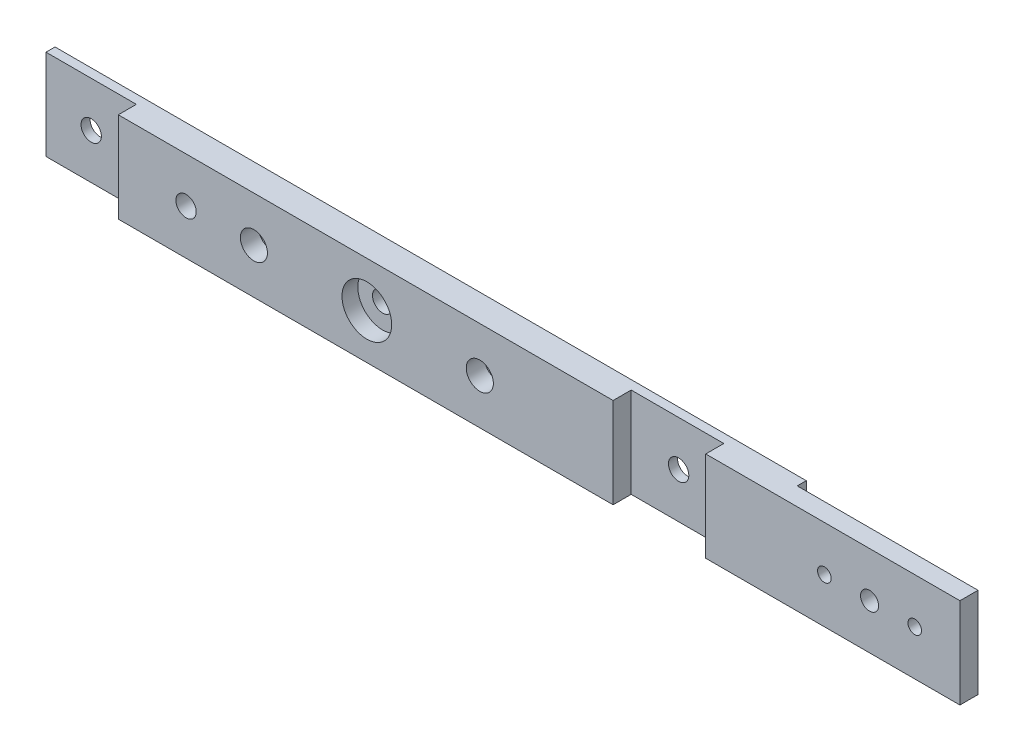
ISO-10303-21;
HEADER;
FILE_DESCRIPTION(('STEP AP214'),'2;1');
FILE_NAME('part.step','',(''),(''),'','','');
FILE_SCHEMA(('AUTOMOTIVE_DESIGN { 1 0 10303 214 1 1 1 1 }'));
ENDSEC;
DATA;
#1=APPLICATION_CONTEXT('core data for automotive mechanical design processes');
#2=APPLICATION_PROTOCOL_DEFINITION('international standard','automotive_design',2000,#1);
#3=PRODUCT_CONTEXT('',#1,'mechanical');
#4=PRODUCT('Part','Part','',(#3));
#5=PRODUCT_RELATED_PRODUCT_CATEGORY('part','',(#4));
#6=PRODUCT_DEFINITION_FORMATION('','',#4);
#7=PRODUCT_DEFINITION_CONTEXT('part definition',#1,'design');
#8=PRODUCT_DEFINITION('design','',#6,#7);
#9=PRODUCT_DEFINITION_SHAPE('','',#8);
#10=(LENGTH_UNIT() NAMED_UNIT(*) SI_UNIT(.MILLI.,.METRE.));
#11=(NAMED_UNIT(*) PLANE_ANGLE_UNIT() SI_UNIT($,.RADIAN.));
#12=(NAMED_UNIT(*) SI_UNIT($,.STERADIAN.) SOLID_ANGLE_UNIT());
#13=UNCERTAINTY_MEASURE_WITH_UNIT(LENGTH_MEASURE(1.E-05),#10,'distance_accuracy_value','');
#14=(GEOMETRIC_REPRESENTATION_CONTEXT(3) GLOBAL_UNCERTAINTY_ASSIGNED_CONTEXT((#13)) GLOBAL_UNIT_ASSIGNED_CONTEXT((#10,
#11,#12)) REPRESENTATION_CONTEXT('',''));
#15=CARTESIAN_POINT('',(0.,0.,0.));
#16=DIRECTION('',(0.,0.,1.));
#17=DIRECTION('',(1.,0.,0.));
#18=AXIS2_PLACEMENT_3D('',#15,#16,#17);
#19=CARTESIAN_POINT('',(185.410070824637,56.9647937411095,12.));
#20=DIRECTION('',(-1.,0.,0.));
#21=DIRECTION('',(0.,-1.,0.));
#22=AXIS2_PLACEMENT_3D('',#19,#20,#21);
#23=PLANE('',#22);
#24=DIRECTION('',(0.,-1.,0.));
#25=VECTOR('',#24,1.);
#26=CARTESIAN_POINT('',(185.410070824637,56.9647937411095,4.));
#27=LINE('',#26,#25);
#28=CARTESIAN_POINT('',(185.410070824637,56.9647937411095,4.));
#29=VERTEX_POINT('',#28);
#30=CARTESIAN_POINT('',(185.410070824637,16.9647937411095,4.));
#31=VERTEX_POINT('',#30);
#32=EDGE_CURVE('E124',#29,#31,#27,.T.);
#33=ORIENTED_EDGE('',*,*,#32,.F.);
#34=DIRECTION('',(0.,0.,-1.));
#35=VECTOR('',#34,1.);
#36=CARTESIAN_POINT('',(185.410070824637,56.9647937411095,12.));
#37=LINE('',#36,#35);
#38=CARTESIAN_POINT('',(185.410070824637,56.9647937411095,12.));
#39=VERTEX_POINT('',#38);
#40=EDGE_CURVE('E146',#39,#29,#37,.T.);
#41=ORIENTED_EDGE('',*,*,#40,.F.);
#42=DIRECTION('',(0.,1.,0.));
#43=VECTOR('',#42,1.);
#44=CARTESIAN_POINT('',(185.410070824637,56.9647937411095,12.));
#45=LINE('',#44,#43);
#46=CARTESIAN_POINT('',(185.410070824637,16.9647937411095,12.));
#47=VERTEX_POINT('',#46);
#48=EDGE_CURVE('E145',#47,#39,#45,.T.);
#49=ORIENTED_EDGE('',*,*,#48,.F.);
#50=DIRECTION('',(0.,0.,-1.));
#51=VECTOR('',#50,1.);
#52=CARTESIAN_POINT('',(185.410070824637,16.9647937411095,12.));
#53=LINE('',#52,#51);
#54=EDGE_CURVE('E43',#47,#31,#53,.T.);
#55=ORIENTED_EDGE('',*,*,#54,.T.);
#56=EDGE_LOOP('',(#33,#41,#49,#55));
#57=FACE_BOUND('',#56,.T.);
#58=ADVANCED_FACE('F34',(#57),#23,.F.);
#59=CARTESIAN_POINT('',(0.,0.,12.));
#60=DIRECTION('',(0.,0.,1.));
#61=DIRECTION('',(1.,0.,0.));
#62=AXIS2_PLACEMENT_3D('',#59,#60,#61);
#63=PLANE('',#62);
#64=CARTESIAN_POINT('',(-27.0899291753633,36.9647937411095,12.));
#65=DIRECTION('',(0.,0.,1.));
#66=DIRECTION('',(1.,0.,0.));
#67=AXIS2_PLACEMENT_3D('',#64,#65,#66);
#68=CIRCLE('',#67,6.);
#69=CARTESIAN_POINT('',(-21.0899291753633,36.9647937411095,12.));
#70=VERTEX_POINT('',#69);
#71=EDGE_CURVE('E454',#70,#70,#68,.T.);
#72=ORIENTED_EDGE('',*,*,#71,.F.);
#73=EDGE_LOOP('',(#72));
#74=FACE_BOUND('',#73,.T.);
#75=CARTESIAN_POINT('',(-127.089929175363,36.9647937411095,12.));
#76=DIRECTION('',(0.,0.,1.));
#77=DIRECTION('',(1.,0.,0.));
#78=AXIS2_PLACEMENT_3D('',#75,#76,#77);
#79=CIRCLE('',#78,6.00000000000002);
#80=CARTESIAN_POINT('',(-121.089929175363,36.9647937411095,12.));
#81=VERTEX_POINT('',#80);
#82=EDGE_CURVE('E447',#81,#81,#79,.T.);
#83=ORIENTED_EDGE('',*,*,#82,.F.);
#84=EDGE_LOOP('',(#83));
#85=FACE_BOUND('',#84,.T.);
#86=DIRECTION('',(0.,-1.,0.));
#87=VECTOR('',#86,1.);
#88=CARTESIAN_POINT('',(31.9100708246367,56.9647937411095,12.));
#89=LINE('',#88,#87);
#90=CARTESIAN_POINT('',(31.9100708246367,56.9647937411095,12.));
#91=VERTEX_POINT('',#90);
#92=CARTESIAN_POINT('',(31.9100708246367,16.9647937411095,12.));
#93=VERTEX_POINT('',#92);
#94=EDGE_CURVE('E443',#91,#93,#89,.T.);
#95=ORIENTED_EDGE('',*,*,#94,.F.);
#96=DIRECTION('',(-1.,0.,0.));
#97=VECTOR('',#96,1.);
#98=CARTESIAN_POINT('',(-227.089929175363,56.9647937411095,12.));
#99=LINE('',#98,#97);
#100=CARTESIAN_POINT('',(-187.089929175363,56.9647937411095,12.));
#101=VERTEX_POINT('',#100);
#102=EDGE_CURVE('E192',#91,#101,#99,.T.);
#103=ORIENTED_EDGE('',*,*,#102,.T.);
#104=DIRECTION('',(0.,1.,0.));
#105=VECTOR('',#104,1.);
#106=CARTESIAN_POINT('',(-187.089929175363,56.9647937411095,12.));
#107=LINE('',#106,#105);
#108=CARTESIAN_POINT('',(-187.089929175363,16.9647937411095,12.));
#109=VERTEX_POINT('',#108);
#110=EDGE_CURVE('E169',#109,#101,#107,.T.);
#111=ORIENTED_EDGE('',*,*,#110,.F.);
#112=DIRECTION('',(1.,0.,0.));
#113=VECTOR('',#112,1.);
#114=CARTESIAN_POINT('',(-227.089929175363,16.9647937411095,12.));
#115=LINE('',#114,#113);
#116=EDGE_CURVE('E187',#109,#93,#115,.T.);
#117=ORIENTED_EDGE('',*,*,#116,.T.);
#118=EDGE_LOOP('',(#95,#103,#111,#117));
#119=FACE_BOUND('',#118,.T.);
#120=CARTESIAN_POINT('',(-157.089929175363,36.9647937411095,12.));
#121=DIRECTION('',(0.,0.,1.));
#122=DIRECTION('',(1.,0.,0.));
#123=AXIS2_PLACEMENT_3D('',#120,#121,#122);
#124=CIRCLE('',#123,4.49999999999999);
#125=CARTESIAN_POINT('',(-152.589929175363,36.9647937411095,12.));
#126=VERTEX_POINT('',#125);
#127=EDGE_CURVE('E177',#126,#126,#124,.T.);
#128=ORIENTED_EDGE('',*,*,#127,.F.);
#129=EDGE_LOOP('',(#128));
#130=FACE_BOUND('',#129,.T.);
#131=CARTESIAN_POINT('',(-77.0899291753633,36.9647937411095,12.));
#132=DIRECTION('',(0.,0.,1.));
#133=DIRECTION('',(1.,0.,0.));
#134=AXIS2_PLACEMENT_3D('',#131,#132,#133);
#135=CIRCLE('',#134,11.);
#136=CARTESIAN_POINT('',(-66.0899291753633,36.9647937411095,12.));
#137=VERTEX_POINT('',#136);
#138=EDGE_CURVE('E153',#137,#137,#135,.T.);
#139=ORIENTED_EDGE('',*,*,#138,.F.);
#140=EDGE_LOOP('',(#139));
#141=FACE_BOUND('',#140,.T.);
#142=ADVANCED_FACE('F236',(#74,#85,#119,#130,#141),#63,.T.);
#143=CARTESIAN_POINT('',(-227.089929175363,56.9647937411095,12.));
#144=DIRECTION('',(1.,0.,0.));
#145=DIRECTION('',(0.,0.,-1.));
#146=AXIS2_PLACEMENT_3D('',#143,#144,#145);
#147=PLANE('',#146);
#148=DIRECTION('',(0.,-1.,0.));
#149=VECTOR('',#148,1.);
#150=CARTESIAN_POINT('',(-227.089929175363,56.9647937411095,4.));
#151=LINE('',#150,#149);
#152=CARTESIAN_POINT('',(-227.089929175363,56.9647937411095,4.));
#153=VERTEX_POINT('',#152);
#154=CARTESIAN_POINT('',(-227.089929175363,16.9647937411095,4.));
#155=VERTEX_POINT('',#154);
#156=EDGE_CURVE('E207',#153,#155,#151,.T.);
#157=ORIENTED_EDGE('',*,*,#156,.F.);
#158=DIRECTION('',(0.,0.,-1.));
#159=VECTOR('',#158,1.);
#160=CARTESIAN_POINT('',(-227.089929175363,56.9647937411095,12.));
#161=LINE('',#160,#159);
#162=CARTESIAN_POINT('',(-227.089929175363,56.9647937411095,0.));
#163=VERTEX_POINT('',#162);
#164=EDGE_CURVE('E148',#153,#163,#161,.T.);
#165=ORIENTED_EDGE('',*,*,#164,.T.);
#166=DIRECTION('',(0.,-1.,0.));
#167=VECTOR('',#166,1.);
#168=CARTESIAN_POINT('',(-227.089929175363,56.9647937411095,0.));
#169=LINE('',#168,#167);
#170=CARTESIAN_POINT('',(-227.089929175363,16.9647937411095,0.));
#171=VERTEX_POINT('',#170);
#172=EDGE_CURVE('E186',#163,#171,#169,.T.);
#173=ORIENTED_EDGE('',*,*,#172,.T.);
#174=DIRECTION('',(0.,0.,-1.));
#175=VECTOR('',#174,1.);
#176=CARTESIAN_POINT('',(-227.089929175363,16.9647937411095,12.));
#177=LINE('',#176,#175);
#178=EDGE_CURVE('E11',#155,#171,#177,.T.);
#179=ORIENTED_EDGE('',*,*,#178,.F.);
#180=EDGE_LOOP('',(#157,#165,#173,#179));
#181=FACE_BOUND('',#180,.T.);
#182=ADVANCED_FACE('F36',(#181),#147,.F.);
#183=CARTESIAN_POINT('',(-207.089929175363,36.9647937411095,0.));
#184=DIRECTION('',(0.,0.,1.));
#185=DIRECTION('',(1.,0.,0.));
#186=AXIS2_PLACEMENT_3D('',#183,#184,#185);
#187=CYLINDRICAL_SURFACE('',#186,4.49999999999999);
#188=CARTESIAN_POINT('',(-207.089929175363,36.9647937411095,0.));
#189=DIRECTION('',(0.,0.,1.));
#190=DIRECTION('',(1.,0.,0.));
#191=AXIS2_PLACEMENT_3D('',#188,#189,#190);
#192=CIRCLE('',#191,4.49999999999999);
#193=CARTESIAN_POINT('',(-202.589929175363,36.9647937411095,0.));
#194=VERTEX_POINT('',#193);
#195=EDGE_CURVE('E181',#194,#194,#192,.T.);
#196=ORIENTED_EDGE('',*,*,#195,.F.);
#197=EDGE_LOOP('',(#196));
#198=FACE_BOUND('',#197,.T.);
#199=CARTESIAN_POINT('',(-207.089929175363,36.9647937411095,4.));
#200=DIRECTION('',(0.,0.,1.));
#201=DIRECTION('',(1.,0.,0.));
#202=AXIS2_PLACEMENT_3D('',#199,#200,#201);
#203=CIRCLE('',#202,4.49999999999999);
#204=CARTESIAN_POINT('',(-202.589929175363,36.9647937411095,4.));
#205=VERTEX_POINT('',#204);
#206=EDGE_CURVE('E151',#205,#205,#203,.F.);
#207=ORIENTED_EDGE('',*,*,#206,.F.);
#208=EDGE_LOOP('',(#207));
#209=FACE_BOUND('',#208,.T.);
#210=ADVANCED_FACE('F237',(#198,#209),#187,.F.);
#211=CARTESIAN_POINT('',(-227.089929175363,16.9647937411095,12.));
#212=DIRECTION('',(0.,1.,0.));
#213=DIRECTION('',(0.,0.,1.));
#214=AXIS2_PLACEMENT_3D('',#211,#212,#213);
#215=PLANE('',#214);
#216=DIRECTION('',(1.,0.,0.));
#217=VECTOR('',#216,1.);
#218=CARTESIAN_POINT('',(-227.089929175363,16.9647937411095,0.));
#219=LINE('',#218,#217);
#220=CARTESIAN_POINT('',(105.410070824637,16.9647937411095,0.));
#221=VERTEX_POINT('',#220);
#222=EDGE_CURVE('E198',#171,#221,#219,.T.);
#223=ORIENTED_EDGE('',*,*,#222,.T.);
#224=DIRECTION('',(0.,0.,-1.));
#225=VECTOR('',#224,1.);
#226=CARTESIAN_POINT('',(105.410070824637,16.9647937411095,4.));
#227=LINE('',#226,#225);
#228=CARTESIAN_POINT('',(105.410070824637,16.9647937411095,4.));
#229=VERTEX_POINT('',#228);
#230=EDGE_CURVE('E51',#229,#221,#227,.T.);
#231=ORIENTED_EDGE('',*,*,#230,.F.);
#232=DIRECTION('',(-1.,0.,0.));
#233=VECTOR('',#232,1.);
#234=CARTESIAN_POINT('',(185.410070824637,16.9647937411095,4.));
#235=LINE('',#234,#233);
#236=EDGE_CURVE('E128',#31,#229,#235,.T.);
#237=ORIENTED_EDGE('',*,*,#236,.F.);
#238=ORIENTED_EDGE('',*,*,#54,.F.);
#239=CARTESIAN_POINT('',(72.9100708246367,16.9647937411095,12.));
#240=VERTEX_POINT('',#239);
#241=EDGE_CURVE('E190',#240,#47,#115,.T.);
#242=ORIENTED_EDGE('',*,*,#241,.F.);
#243=DIRECTION('',(0.,0.,1.));
#244=VECTOR('',#243,1.);
#245=CARTESIAN_POINT('',(72.9100708246367,16.9647937411095,4.));
#246=LINE('',#245,#244);
#247=CARTESIAN_POINT('',(72.9100708246367,16.9647937411095,4.));
#248=VERTEX_POINT('',#247);
#249=EDGE_CURVE('E59',#248,#240,#246,.T.);
#250=ORIENTED_EDGE('',*,*,#249,.F.);
#251=DIRECTION('',(1.,0.,0.));
#252=VECTOR('',#251,1.);
#253=CARTESIAN_POINT('',(72.9100708246367,16.9647937411095,4.));
#254=LINE('',#253,#252);
#255=CARTESIAN_POINT('',(31.9100708246367,16.9647937411095,4.));
#256=VERTEX_POINT('',#255);
#257=EDGE_CURVE('E440',#256,#248,#254,.T.);
#258=ORIENTED_EDGE('',*,*,#257,.F.);
#259=DIRECTION('',(0.,0.,1.));
#260=VECTOR('',#259,1.);
#261=CARTESIAN_POINT('',(31.9100708246367,16.9647937411095,4.));
#262=LINE('',#261,#260);
#263=EDGE_CURVE('E430',#256,#93,#262,.T.);
#264=ORIENTED_EDGE('',*,*,#263,.T.);
#265=ORIENTED_EDGE('',*,*,#116,.F.);
#266=DIRECTION('',(0.,0.,1.));
#267=VECTOR('',#266,1.);
#268=CARTESIAN_POINT('',(-187.089929175363,16.9647937411095,4.));
#269=LINE('',#268,#267);
#270=CARTESIAN_POINT('',(-187.089929175363,16.9647937411095,4.));
#271=VERTEX_POINT('',#270);
#272=EDGE_CURVE('E161',#271,#109,#269,.T.);
#273=ORIENTED_EDGE('',*,*,#272,.F.);
#274=DIRECTION('',(1.,0.,0.));
#275=VECTOR('',#274,1.);
#276=CARTESIAN_POINT('',(-227.089929175363,16.9647937411095,4.));
#277=LINE('',#276,#275);
#278=EDGE_CURVE('E215',#155,#271,#277,.T.);
#279=ORIENTED_EDGE('',*,*,#278,.F.);
#280=ORIENTED_EDGE('',*,*,#178,.T.);
#281=EDGE_LOOP('',(#223,#231,#237,#238,#242,#250,#258,#264,#265,#273,#279,#280));
#282=FACE_BOUND('',#281,.T.);
#283=ADVANCED_FACE('F140',(#282),#215,.F.);
#284=CARTESIAN_POINT('',(-227.089929175363,56.9647937411095,12.));
#285=DIRECTION('',(0.,-1.,0.));
#286=DIRECTION('',(0.,0.,-1.));
#287=AXIS2_PLACEMENT_3D('',#284,#285,#286);
#288=PLANE('',#287);
#289=DIRECTION('',(1.,0.,0.));
#290=VECTOR('',#289,1.);
#291=CARTESIAN_POINT('',(185.410070824637,56.9647937411095,4.));
#292=LINE('',#291,#290);
#293=CARTESIAN_POINT('',(105.410070824637,56.9647937411095,4.));
#294=VERTEX_POINT('',#293);
#295=EDGE_CURVE('E130',#294,#29,#292,.T.);
#296=ORIENTED_EDGE('',*,*,#295,.F.);
#297=DIRECTION('',(0.,0.,-1.));
#298=VECTOR('',#297,1.);
#299=CARTESIAN_POINT('',(105.410070824637,56.9647937411095,4.));
#300=LINE('',#299,#298);
#301=CARTESIAN_POINT('',(105.410070824637,56.9647937411095,0.));
#302=VERTEX_POINT('',#301);
#303=EDGE_CURVE('E469',#294,#302,#300,.T.);
#304=ORIENTED_EDGE('',*,*,#303,.T.);
#305=DIRECTION('',(-1.,0.,0.));
#306=VECTOR('',#305,1.);
#307=CARTESIAN_POINT('',(-227.089929175363,56.9647937411095,0.));
#308=LINE('',#307,#306);
#309=EDGE_CURVE('E200',#302,#163,#308,.T.);
#310=ORIENTED_EDGE('',*,*,#309,.T.);
#311=ORIENTED_EDGE('',*,*,#164,.F.);
#312=DIRECTION('',(-1.,0.,0.));
#313=VECTOR('',#312,1.);
#314=CARTESIAN_POINT('',(-227.089929175363,56.9647937411095,4.));
#315=LINE('',#314,#313);
#316=CARTESIAN_POINT('',(-187.089929175363,56.9647937411095,4.));
#317=VERTEX_POINT('',#316);
#318=EDGE_CURVE('E166',#317,#153,#315,.T.);
#319=ORIENTED_EDGE('',*,*,#318,.F.);
#320=DIRECTION('',(0.,0.,1.));
#321=VECTOR('',#320,1.);
#322=CARTESIAN_POINT('',(-187.089929175363,56.9647937411095,4.));
#323=LINE('',#322,#321);
#324=EDGE_CURVE('E154',#317,#101,#323,.T.);
#325=ORIENTED_EDGE('',*,*,#324,.T.);
#326=ORIENTED_EDGE('',*,*,#102,.F.);
#327=DIRECTION('',(0.,0.,1.));
#328=VECTOR('',#327,1.);
#329=CARTESIAN_POINT('',(31.9100708246367,56.9647937411095,4.));
#330=LINE('',#329,#328);
#331=CARTESIAN_POINT('',(31.9100708246367,56.9647937411095,4.));
#332=VERTEX_POINT('',#331);
#333=EDGE_CURVE('E418',#332,#91,#330,.T.);
#334=ORIENTED_EDGE('',*,*,#333,.F.);
#335=DIRECTION('',(-1.,0.,0.));
#336=VECTOR('',#335,1.);
#337=CARTESIAN_POINT('',(72.9100708246367,56.9647937411095,4.));
#338=LINE('',#337,#336);
#339=CARTESIAN_POINT('',(72.9100708246367,56.9647937411095,4.));
#340=VERTEX_POINT('',#339);
#341=EDGE_CURVE('E432',#340,#332,#338,.T.);
#342=ORIENTED_EDGE('',*,*,#341,.F.);
#343=DIRECTION('',(0.,0.,1.));
#344=VECTOR('',#343,1.);
#345=CARTESIAN_POINT('',(72.9100708246367,56.9647937411095,4.));
#346=LINE('',#345,#344);
#347=CARTESIAN_POINT('',(72.9100708246367,56.9647937411095,12.));
#348=VERTEX_POINT('',#347);
#349=EDGE_CURVE('E420',#340,#348,#346,.T.);
#350=ORIENTED_EDGE('',*,*,#349,.T.);
#351=EDGE_CURVE('E193',#39,#348,#99,.T.);
#352=ORIENTED_EDGE('',*,*,#351,.F.);
#353=ORIENTED_EDGE('',*,*,#40,.T.);
#354=EDGE_LOOP('',(#296,#304,#310,#311,#319,#325,#326,#334,#342,#350,#352,#353));
#355=FACE_BOUND('',#354,.T.);
#356=ADVANCED_FACE('F225',(#355),#288,.F.);
#357=CARTESIAN_POINT('',(145.410070824637,36.9647937411095,12.));
#358=DIRECTION('',(0.,0.,-1.));
#359=DIRECTION('',(-1.,0.,0.));
#360=AXIS2_PLACEMENT_3D('',#357,#358,#359);
#361=CIRCLE('',#360,3.99999999999999);
#362=CARTESIAN_POINT('',(141.410070824637,36.9647937411095,12.));
#363=VERTEX_POINT('',#362);
#364=EDGE_CURVE('E487',#363,#363,#361,.T.);
#365=ORIENTED_EDGE('',*,*,#364,.T.);
#366=EDGE_LOOP('',(#365));
#367=FACE_BOUND('',#366,.T.);
#368=CARTESIAN_POINT('',(125.410070824637,36.9647937411095,12.));
#369=DIRECTION('',(0.,0.,-1.));
#370=DIRECTION('',(-1.,0.,0.));
#371=AXIS2_PLACEMENT_3D('',#368,#369,#370);
#372=CIRCLE('',#371,2.99999999999999);
#373=CARTESIAN_POINT('',(122.410070824637,36.9647937411095,12.));
#374=VERTEX_POINT('',#373);
#375=EDGE_CURVE('E481',#374,#374,#372,.T.);
#376=ORIENTED_EDGE('',*,*,#375,.T.);
#377=EDGE_LOOP('',(#376));
#378=FACE_BOUND('',#377,.T.);
#379=CARTESIAN_POINT('',(165.410070824637,36.9647937411095,12.));
#380=DIRECTION('',(0.,0.,-1.));
#381=DIRECTION('',(-1.,0.,0.));
#382=AXIS2_PLACEMENT_3D('',#379,#380,#381);
#383=CIRCLE('',#382,2.99999999999999);
#384=CARTESIAN_POINT('',(162.410070824637,36.9647937411095,12.));
#385=VERTEX_POINT('',#384);
#386=EDGE_CURVE('E475',#385,#385,#383,.T.);
#387=ORIENTED_EDGE('',*,*,#386,.T.);
#388=EDGE_LOOP('',(#387));
#389=FACE_BOUND('',#388,.T.);
#390=DIRECTION('',(0.,1.,0.));
#391=VECTOR('',#390,1.);
#392=CARTESIAN_POINT('',(72.9100708246367,56.9647937411095,12.));
#393=LINE('',#392,#391);
#394=EDGE_CURVE('E427',#240,#348,#393,.T.);
#395=ORIENTED_EDGE('',*,*,#394,.F.);
#396=ORIENTED_EDGE('',*,*,#241,.T.);
#397=ORIENTED_EDGE('',*,*,#48,.T.);
#398=ORIENTED_EDGE('',*,*,#351,.T.);
#399=EDGE_LOOP('',(#395,#396,#397,#398));
#400=FACE_BOUND('',#399,.T.);
#401=ADVANCED_FACE('F228',(#367,#378,#389,#400),#63,.T.);
#402=CARTESIAN_POINT('',(0.,0.,0.));
#403=DIRECTION('',(0.,0.,1.));
#404=DIRECTION('',(1.,0.,0.));
#405=AXIS2_PLACEMENT_3D('',#402,#403,#404);
#406=PLANE('',#405);
#407=CARTESIAN_POINT('',(-77.0899291753633,36.9647937411095,0.));
#408=DIRECTION('',(0.,0.,1.));
#409=DIRECTION('',(1.,0.,0.));
#410=AXIS2_PLACEMENT_3D('',#407,#408,#409);
#411=CIRCLE('',#410,4.50000000000001);
#412=CARTESIAN_POINT('',(-72.5899291753633,36.9647937411095,0.));
#413=VERTEX_POINT('',#412);
#414=EDGE_CURVE('E263',#413,#413,#411,.T.);
#415=ORIENTED_EDGE('',*,*,#414,.T.);
#416=EDGE_LOOP('',(#415));
#417=FACE_BOUND('',#416,.T.);
#418=CARTESIAN_POINT('',(52.9100708246367,36.9647937411095,0.));
#419=DIRECTION('',(0.,0.,1.));
#420=DIRECTION('',(1.,0.,0.));
#421=AXIS2_PLACEMENT_3D('',#418,#419,#420);
#422=CIRCLE('',#421,4.5);
#423=CARTESIAN_POINT('',(57.4100708246366,36.9647937411095,0.));
#424=VERTEX_POINT('',#423);
#425=EDGE_CURVE('E173',#424,#424,#422,.T.);
#426=ORIENTED_EDGE('',*,*,#425,.T.);
#427=EDGE_LOOP('',(#426));
#428=FACE_BOUND('',#427,.T.);
#429=CARTESIAN_POINT('',(-157.089929175363,36.9647937411095,0.));
#430=DIRECTION('',(0.,0.,1.));
#431=DIRECTION('',(1.,0.,0.));
#432=AXIS2_PLACEMENT_3D('',#429,#430,#431);
#433=CIRCLE('',#432,4.49999999999999);
#434=CARTESIAN_POINT('',(-152.589929175363,36.9647937411095,0.));
#435=VERTEX_POINT('',#434);
#436=EDGE_CURVE('E178',#435,#435,#433,.T.);
#437=ORIENTED_EDGE('',*,*,#436,.T.);
#438=EDGE_LOOP('',(#437));
#439=FACE_BOUND('',#438,.T.);
#440=ORIENTED_EDGE('',*,*,#195,.T.);
#441=EDGE_LOOP('',(#440));
#442=FACE_BOUND('',#441,.T.);
#443=ORIENTED_EDGE('',*,*,#309,.F.);
#444=DIRECTION('',(0.,1.,0.));
#445=VECTOR('',#444,1.);
#446=CARTESIAN_POINT('',(105.410070824637,56.9647937411095,0.));
#447=LINE('',#446,#445);
#448=EDGE_CURVE('E135',#221,#302,#447,.T.);
#449=ORIENTED_EDGE('',*,*,#448,.F.);
#450=ORIENTED_EDGE('',*,*,#222,.F.);
#451=ORIENTED_EDGE('',*,*,#172,.F.);
#452=EDGE_LOOP('',(#443,#449,#450,#451));
#453=FACE_BOUND('',#452,.T.);
#454=ADVANCED_FACE('F211',(#417,#428,#439,#442,#453),#406,.F.);
#455=CARTESIAN_POINT('',(-157.089929175363,36.9647937411095,0.));
#456=DIRECTION('',(0.,0.,1.));
#457=DIRECTION('',(1.,0.,0.));
#458=AXIS2_PLACEMENT_3D('',#455,#456,#457);
#459=CYLINDRICAL_SURFACE('',#458,4.49999999999999);
#460=ORIENTED_EDGE('',*,*,#436,.F.);
#461=EDGE_LOOP('',(#460));
#462=FACE_BOUND('',#461,.T.);
#463=ORIENTED_EDGE('',*,*,#127,.T.);
#464=EDGE_LOOP('',(#463));
#465=FACE_BOUND('',#464,.T.);
#466=ADVANCED_FACE('F253',(#462,#465),#459,.F.);
#467=CARTESIAN_POINT('',(52.9100708246367,36.9647937411095,0.));
#468=DIRECTION('',(0.,0.,1.));
#469=DIRECTION('',(1.,0.,0.));
#470=AXIS2_PLACEMENT_3D('',#467,#468,#469);
#471=CYLINDRICAL_SURFACE('',#470,4.5);
#472=CARTESIAN_POINT('',(52.9100708246367,36.9647937411095,4.));
#473=DIRECTION('',(0.,0.,-1.));
#474=DIRECTION('',(-1.,0.,0.));
#475=AXIS2_PLACEMENT_3D('',#472,#473,#474);
#476=CIRCLE('',#475,4.5);
#477=CARTESIAN_POINT('',(48.4100708246367,36.9647937411095,4.));
#478=VERTEX_POINT('',#477);
#479=EDGE_CURVE('E38',#478,#478,#476,.F.);
#480=ORIENTED_EDGE('',*,*,#479,.T.);
#481=EDGE_LOOP('',(#480));
#482=FACE_BOUND('',#481,.T.);
#483=ORIENTED_EDGE('',*,*,#425,.F.);
#484=EDGE_LOOP('',(#483));
#485=FACE_BOUND('',#484,.T.);
#486=ADVANCED_FACE('F258',(#482,#485),#471,.F.);
#487=CARTESIAN_POINT('',(-77.0899291753633,36.9647937411095,5.));
#488=DIRECTION('',(0.,0.,1.));
#489=DIRECTION('',(1.,0.,0.));
#490=AXIS2_PLACEMENT_3D('',#487,#488,#489);
#491=CYLINDRICAL_SURFACE('',#490,11.);
#492=CARTESIAN_POINT('',(-77.0899291753633,36.9647937411095,5.));
#493=DIRECTION('',(0.,0.,1.));
#494=DIRECTION('',(1.,0.,0.));
#495=AXIS2_PLACEMENT_3D('',#492,#493,#494);
#496=CIRCLE('',#495,11.);
#497=CARTESIAN_POINT('',(-66.0899291753633,36.9647937411095,5.));
#498=VERTEX_POINT('',#497);
#499=EDGE_CURVE('E158',#498,#498,#496,.T.);
#500=ORIENTED_EDGE('',*,*,#499,.F.);
#501=EDGE_LOOP('',(#500));
#502=FACE_BOUND('',#501,.T.);
#503=ORIENTED_EDGE('',*,*,#138,.T.);
#504=EDGE_LOOP('',(#503));
#505=FACE_BOUND('',#504,.T.);
#506=ADVANCED_FACE('F362',(#502,#505),#491,.F.);
#507=CARTESIAN_POINT('',(-77.0899291753633,36.9647937411095,5.));
#508=DIRECTION('',(0.,0.,1.));
#509=DIRECTION('',(1.,0.,0.));
#510=AXIS2_PLACEMENT_3D('',#507,#508,#509);
#511=PLANE('',#510);
#512=CARTESIAN_POINT('',(-77.0899291753633,36.9647937411095,5.));
#513=DIRECTION('',(0.,0.,1.));
#514=DIRECTION('',(1.,0.,0.));
#515=AXIS2_PLACEMENT_3D('',#512,#513,#514);
#516=CIRCLE('',#515,4.50000000000001);
#517=CARTESIAN_POINT('',(-72.5899291753633,36.9647937411095,5.));
#518=VERTEX_POINT('',#517);
#519=EDGE_CURVE('E495',#518,#518,#516,.T.);
#520=ORIENTED_EDGE('',*,*,#519,.F.);
#521=EDGE_LOOP('',(#520));
#522=FACE_BOUND('',#521,.T.);
#523=ORIENTED_EDGE('',*,*,#499,.T.);
#524=EDGE_LOOP('',(#523));
#525=FACE_BOUND('',#524,.T.);
#526=ADVANCED_FACE('F357',(#522,#525),#511,.T.);
#527=CARTESIAN_POINT('',(0.,0.,4.));
#528=DIRECTION('',(0.,0.,1.));
#529=DIRECTION('',(1.,0.,0.));
#530=AXIS2_PLACEMENT_3D('',#527,#528,#529);
#531=PLANE('',#530);
#532=ORIENTED_EDGE('',*,*,#156,.T.);
#533=ORIENTED_EDGE('',*,*,#278,.T.);
#534=DIRECTION('',(0.,1.,0.));
#535=VECTOR('',#534,1.);
#536=CARTESIAN_POINT('',(-187.089929175363,56.9647937411095,4.));
#537=LINE('',#536,#535);
#538=EDGE_CURVE('E219',#271,#317,#537,.T.);
#539=ORIENTED_EDGE('',*,*,#538,.T.);
#540=ORIENTED_EDGE('',*,*,#318,.T.);
#541=EDGE_LOOP('',(#532,#533,#539,#540));
#542=FACE_BOUND('',#541,.T.);
#543=ORIENTED_EDGE('',*,*,#206,.T.);
#544=EDGE_LOOP('',(#543));
#545=FACE_BOUND('',#544,.T.);
#546=ADVANCED_FACE('F224',(#542,#545),#531,.T.);
#547=CARTESIAN_POINT('',(-187.089929175363,56.9647937411095,4.));
#548=DIRECTION('',(1.,0.,0.));
#549=DIRECTION('',(0.,0.,-1.));
#550=AXIS2_PLACEMENT_3D('',#547,#548,#549);
#551=PLANE('',#550);
#552=ORIENTED_EDGE('',*,*,#110,.T.);
#553=ORIENTED_EDGE('',*,*,#324,.F.);
#554=ORIENTED_EDGE('',*,*,#538,.F.);
#555=ORIENTED_EDGE('',*,*,#272,.T.);
#556=EDGE_LOOP('',(#552,#553,#554,#555));
#557=FACE_BOUND('',#556,.T.);
#558=ADVANCED_FACE('F398',(#557),#551,.F.);
#559=CARTESIAN_POINT('',(0.,0.,4.));
#560=DIRECTION('',(0.,0.,-1.));
#561=DIRECTION('',(-1.,0.,0.));
#562=AXIS2_PLACEMENT_3D('',#559,#560,#561);
#563=PLANE('',#562);
#564=DIRECTION('',(0.,-1.,0.));
#565=VECTOR('',#564,1.);
#566=CARTESIAN_POINT('',(31.9100708246367,56.9647937411095,4.));
#567=LINE('',#566,#565);
#568=EDGE_CURVE('E445',#332,#256,#567,.T.);
#569=ORIENTED_EDGE('',*,*,#568,.T.);
#570=ORIENTED_EDGE('',*,*,#257,.T.);
#571=DIRECTION('',(0.,1.,0.));
#572=VECTOR('',#571,1.);
#573=CARTESIAN_POINT('',(72.9100708246367,56.9647937411095,4.));
#574=LINE('',#573,#572);
#575=EDGE_CURVE('E435',#248,#340,#574,.T.);
#576=ORIENTED_EDGE('',*,*,#575,.T.);
#577=ORIENTED_EDGE('',*,*,#341,.T.);
#578=EDGE_LOOP('',(#569,#570,#576,#577));
#579=FACE_BOUND('',#578,.T.);
#580=ORIENTED_EDGE('',*,*,#479,.F.);
#581=EDGE_LOOP('',(#580));
#582=FACE_BOUND('',#581,.T.);
#583=ADVANCED_FACE('F394',(#579,#582),#563,.F.);
#584=CARTESIAN_POINT('',(31.9100708246367,56.9647937411095,4.));
#585=DIRECTION('',(-1.,0.,0.));
#586=DIRECTION('',(0.,-1.,0.));
#587=AXIS2_PLACEMENT_3D('',#584,#585,#586);
#588=PLANE('',#587);
#589=ORIENTED_EDGE('',*,*,#94,.T.);
#590=ORIENTED_EDGE('',*,*,#263,.F.);
#591=ORIENTED_EDGE('',*,*,#568,.F.);
#592=ORIENTED_EDGE('',*,*,#333,.T.);
#593=EDGE_LOOP('',(#589,#590,#591,#592));
#594=FACE_BOUND('',#593,.T.);
#595=ADVANCED_FACE('F397',(#594),#588,.F.);
#596=CARTESIAN_POINT('',(72.9100708246367,56.9647937411095,4.));
#597=DIRECTION('',(1.,0.,0.));
#598=DIRECTION('',(0.,1.,0.));
#599=AXIS2_PLACEMENT_3D('',#596,#597,#598);
#600=PLANE('',#599);
#601=ORIENTED_EDGE('',*,*,#394,.T.);
#602=ORIENTED_EDGE('',*,*,#349,.F.);
#603=ORIENTED_EDGE('',*,*,#575,.F.);
#604=ORIENTED_EDGE('',*,*,#249,.T.);
#605=EDGE_LOOP('',(#601,#602,#603,#604));
#606=FACE_BOUND('',#605,.T.);
#607=ADVANCED_FACE('F392',(#606),#600,.F.);
#608=CARTESIAN_POINT('',(-127.089929175363,36.9647937411095,4.));
#609=DIRECTION('',(0.,0.,1.));
#610=DIRECTION('',(1.,0.,0.));
#611=AXIS2_PLACEMENT_3D('',#608,#609,#610);
#612=CYLINDRICAL_SURFACE('',#611,6.00000000000002);
#613=CARTESIAN_POINT('',(-127.089929175363,36.9647937411095,4.));
#614=DIRECTION('',(0.,0.,1.));
#615=DIRECTION('',(1.,0.,0.));
#616=AXIS2_PLACEMENT_3D('',#613,#614,#615);
#617=CIRCLE('',#616,6.00000000000002);
#618=CARTESIAN_POINT('',(-121.089929175363,36.9647937411095,4.));
#619=VERTEX_POINT('',#618);
#620=EDGE_CURVE('E444',#619,#619,#617,.T.);
#621=ORIENTED_EDGE('',*,*,#620,.F.);
#622=EDGE_LOOP('',(#621));
#623=FACE_BOUND('',#622,.T.);
#624=ORIENTED_EDGE('',*,*,#82,.T.);
#625=EDGE_LOOP('',(#624));
#626=FACE_BOUND('',#625,.T.);
#627=ADVANCED_FACE('F388',(#623,#626),#612,.F.);
#628=CARTESIAN_POINT('',(-127.089929175363,36.9647937411095,4.));
#629=DIRECTION('',(0.,0.,1.));
#630=DIRECTION('',(1.,0.,0.));
#631=AXIS2_PLACEMENT_3D('',#628,#629,#630);
#632=PLANE('',#631);
#633=ORIENTED_EDGE('',*,*,#620,.T.);
#634=EDGE_LOOP('',(#633));
#635=FACE_BOUND('',#634,.T.);
#636=ADVANCED_FACE('F384',(#635),#632,.T.);
#637=CARTESIAN_POINT('',(-27.0899291753633,36.9647937411095,4.));
#638=DIRECTION('',(0.,0.,1.));
#639=DIRECTION('',(1.,0.,0.));
#640=AXIS2_PLACEMENT_3D('',#637,#638,#639);
#641=CYLINDRICAL_SURFACE('',#640,6.);
#642=CARTESIAN_POINT('',(-27.0899291753633,36.9647937411095,4.));
#643=DIRECTION('',(0.,0.,1.));
#644=DIRECTION('',(1.,0.,0.));
#645=AXIS2_PLACEMENT_3D('',#642,#643,#644);
#646=CIRCLE('',#645,6.);
#647=CARTESIAN_POINT('',(-21.0899291753633,36.9647937411095,4.));
#648=VERTEX_POINT('',#647);
#649=EDGE_CURVE('E451',#648,#648,#646,.T.);
#650=ORIENTED_EDGE('',*,*,#649,.F.);
#651=EDGE_LOOP('',(#650));
#652=FACE_BOUND('',#651,.T.);
#653=ORIENTED_EDGE('',*,*,#71,.T.);
#654=EDGE_LOOP('',(#653));
#655=FACE_BOUND('',#654,.T.);
#656=ADVANCED_FACE('F380',(#652,#655),#641,.F.);
#657=CARTESIAN_POINT('',(-27.0899291753633,36.9647937411095,4.));
#658=DIRECTION('',(0.,0.,1.));
#659=DIRECTION('',(1.,0.,0.));
#660=AXIS2_PLACEMENT_3D('',#657,#658,#659);
#661=PLANE('',#660);
#662=ORIENTED_EDGE('',*,*,#649,.T.);
#663=EDGE_LOOP('',(#662));
#664=FACE_BOUND('',#663,.T.);
#665=ADVANCED_FACE('F299',(#664),#661,.T.);
#666=CARTESIAN_POINT('',(105.410070824637,56.9647937411095,4.));
#667=DIRECTION('',(-1.,0.,0.));
#668=DIRECTION('',(0.,-1.,0.));
#669=AXIS2_PLACEMENT_3D('',#666,#667,#668);
#670=PLANE('',#669);
#671=ORIENTED_EDGE('',*,*,#448,.T.);
#672=ORIENTED_EDGE('',*,*,#303,.F.);
#673=DIRECTION('',(0.,1.,0.));
#674=VECTOR('',#673,1.);
#675=CARTESIAN_POINT('',(105.410070824637,56.9647937411095,4.));
#676=LINE('',#675,#674);
#677=EDGE_CURVE('E143',#229,#294,#676,.T.);
#678=ORIENTED_EDGE('',*,*,#677,.F.);
#679=ORIENTED_EDGE('',*,*,#230,.T.);
#680=EDGE_LOOP('',(#671,#672,#678,#679));
#681=FACE_BOUND('',#680,.T.);
#682=ADVANCED_FACE('F294',(#681),#670,.F.);
#683=CARTESIAN_POINT('',(0.,0.,4.));
#684=DIRECTION('',(0.,0.,-1.));
#685=DIRECTION('',(-1.,0.,0.));
#686=AXIS2_PLACEMENT_3D('',#683,#684,#685);
#687=PLANE('',#686);
#688=CARTESIAN_POINT('',(145.410070824637,36.9647937411095,4.));
#689=DIRECTION('',(0.,0.,-1.));
#690=DIRECTION('',(-1.,0.,0.));
#691=AXIS2_PLACEMENT_3D('',#688,#689,#690);
#692=CIRCLE('',#691,3.99999999999999);
#693=CARTESIAN_POINT('',(141.410070824637,36.9647937411095,4.));
#694=VERTEX_POINT('',#693);
#695=EDGE_CURVE('E490',#694,#694,#692,.T.);
#696=ORIENTED_EDGE('',*,*,#695,.F.);
#697=EDGE_LOOP('',(#696));
#698=FACE_BOUND('',#697,.T.);
#699=CARTESIAN_POINT('',(125.410070824637,36.9647937411095,4.));
#700=DIRECTION('',(0.,0.,-1.));
#701=DIRECTION('',(-1.,0.,0.));
#702=AXIS2_PLACEMENT_3D('',#699,#700,#701);
#703=CIRCLE('',#702,2.99999999999999);
#704=CARTESIAN_POINT('',(122.410070824637,36.9647937411095,4.));
#705=VERTEX_POINT('',#704);
#706=EDGE_CURVE('E484',#705,#705,#703,.T.);
#707=ORIENTED_EDGE('',*,*,#706,.F.);
#708=EDGE_LOOP('',(#707));
#709=FACE_BOUND('',#708,.T.);
#710=CARTESIAN_POINT('',(165.410070824637,36.9647937411095,4.));
#711=DIRECTION('',(0.,0.,-1.));
#712=DIRECTION('',(-1.,0.,0.));
#713=AXIS2_PLACEMENT_3D('',#710,#711,#712);
#714=CIRCLE('',#713,2.99999999999999);
#715=CARTESIAN_POINT('',(162.410070824637,36.9647937411095,4.));
#716=VERTEX_POINT('',#715);
#717=EDGE_CURVE('E478',#716,#716,#714,.T.);
#718=ORIENTED_EDGE('',*,*,#717,.F.);
#719=EDGE_LOOP('',(#718));
#720=FACE_BOUND('',#719,.T.);
#721=ORIENTED_EDGE('',*,*,#32,.T.);
#722=ORIENTED_EDGE('',*,*,#236,.T.);
#723=ORIENTED_EDGE('',*,*,#677,.T.);
#724=ORIENTED_EDGE('',*,*,#295,.T.);
#725=EDGE_LOOP('',(#721,#722,#723,#724));
#726=FACE_BOUND('',#725,.T.);
#727=ADVANCED_FACE('F126',(#698,#709,#720,#726),#687,.T.);
#728=CARTESIAN_POINT('',(165.410070824637,36.9647937411095,12.));
#729=DIRECTION('',(0.,0.,-1.));
#730=DIRECTION('',(-1.,0.,0.));
#731=AXIS2_PLACEMENT_3D('',#728,#729,#730);
#732=CYLINDRICAL_SURFACE('',#731,2.99999999999999);
#733=ORIENTED_EDGE('',*,*,#386,.F.);
#734=EDGE_LOOP('',(#733));
#735=FACE_BOUND('',#734,.T.);
#736=ORIENTED_EDGE('',*,*,#717,.T.);
#737=EDGE_LOOP('',(#736));
#738=FACE_BOUND('',#737,.T.);
#739=ADVANCED_FACE('F307',(#735,#738),#732,.F.);
#740=CARTESIAN_POINT('',(125.410070824637,36.9647937411095,12.));
#741=DIRECTION('',(0.,0.,-1.));
#742=DIRECTION('',(-1.,0.,0.));
#743=AXIS2_PLACEMENT_3D('',#740,#741,#742);
#744=CYLINDRICAL_SURFACE('',#743,2.99999999999999);
#745=ORIENTED_EDGE('',*,*,#375,.F.);
#746=EDGE_LOOP('',(#745));
#747=FACE_BOUND('',#746,.T.);
#748=ORIENTED_EDGE('',*,*,#706,.T.);
#749=EDGE_LOOP('',(#748));
#750=FACE_BOUND('',#749,.T.);
#751=ADVANCED_FACE('F312',(#747,#750),#744,.F.);
#752=CARTESIAN_POINT('',(145.410070824637,36.9647937411095,12.));
#753=DIRECTION('',(0.,0.,-1.));
#754=DIRECTION('',(-1.,0.,0.));
#755=AXIS2_PLACEMENT_3D('',#752,#753,#754);
#756=CYLINDRICAL_SURFACE('',#755,3.99999999999999);
#757=ORIENTED_EDGE('',*,*,#364,.F.);
#758=EDGE_LOOP('',(#757));
#759=FACE_BOUND('',#758,.T.);
#760=ORIENTED_EDGE('',*,*,#695,.T.);
#761=EDGE_LOOP('',(#760));
#762=FACE_BOUND('',#761,.T.);
#763=ADVANCED_FACE('F322',(#759,#762),#756,.F.);
#764=CARTESIAN_POINT('',(-77.0899291753633,36.9647937411095,0.));
#765=DIRECTION('',(0.,0.,1.));
#766=DIRECTION('',(1.,0.,0.));
#767=AXIS2_PLACEMENT_3D('',#764,#765,#766);
#768=CYLINDRICAL_SURFACE('',#767,4.50000000000001);
#769=ORIENTED_EDGE('',*,*,#414,.F.);
#770=EDGE_LOOP('',(#769));
#771=FACE_BOUND('',#770,.T.);
#772=ORIENTED_EDGE('',*,*,#519,.T.);
#773=EDGE_LOOP('',(#772));
#774=FACE_BOUND('',#773,.T.);
#775=ADVANCED_FACE('F344',(#771,#774),#768,.F.);
#776=CLOSED_SHELL('',(#58,#142,#182,#210,#283,#356,#401,#454,#466,#486,#506,#526,#546,#558,#583,
#595,#607,#627,#636,#656,#665,#682,#727,#739,#751,#763,#775));
#777=MANIFOLD_SOLID_BREP('B2',#776);
#778=ADVANCED_BREP_SHAPE_REPRESENTATION('',(#18,#777),#14);
#779=SHAPE_DEFINITION_REPRESENTATION(#9,#778);
ENDSEC;
END-ISO-10303-21;
